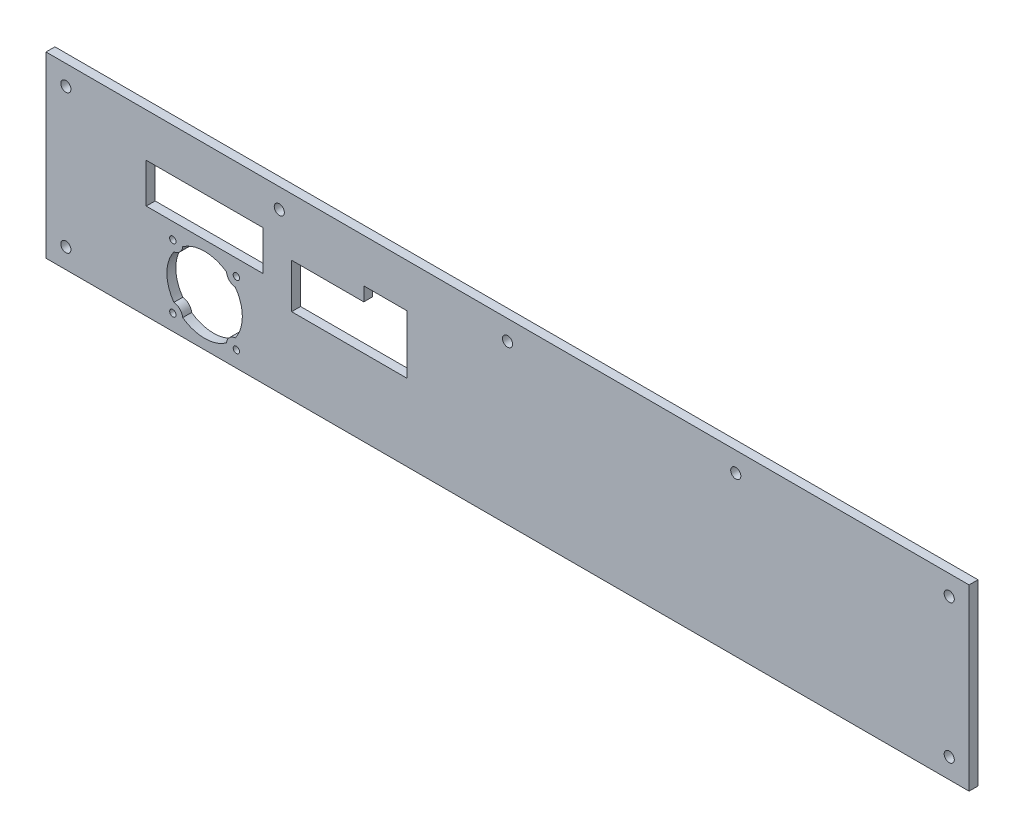
ISO-10303-21;
HEADER;
FILE_DESCRIPTION(('STEP AP214'),'2;1');
FILE_NAME('part.step','',(''),(''),'','','');
FILE_SCHEMA(('AUTOMOTIVE_DESIGN { 1 0 10303 214 1 1 1 1 }'));
ENDSEC;
DATA;
#1=APPLICATION_CONTEXT('core data for automotive mechanical design processes');
#2=APPLICATION_PROTOCOL_DEFINITION('international standard','automotive_design',2000,#1);
#3=PRODUCT_CONTEXT('',#1,'mechanical');
#4=PRODUCT('Part','Part','',(#3));
#5=PRODUCT_RELATED_PRODUCT_CATEGORY('part','',(#4));
#6=PRODUCT_DEFINITION_FORMATION('','',#4);
#7=PRODUCT_DEFINITION_CONTEXT('part definition',#1,'design');
#8=PRODUCT_DEFINITION('design','',#6,#7);
#9=PRODUCT_DEFINITION_SHAPE('','',#8);
#10=(LENGTH_UNIT() NAMED_UNIT(*) SI_UNIT(.MILLI.,.METRE.));
#11=(NAMED_UNIT(*) PLANE_ANGLE_UNIT() SI_UNIT($,.RADIAN.));
#12=(NAMED_UNIT(*) SI_UNIT($,.STERADIAN.) SOLID_ANGLE_UNIT());
#13=UNCERTAINTY_MEASURE_WITH_UNIT(LENGTH_MEASURE(1.E-05),#10,'distance_accuracy_value','');
#14=(GEOMETRIC_REPRESENTATION_CONTEXT(3) GLOBAL_UNCERTAINTY_ASSIGNED_CONTEXT((#13)) GLOBAL_UNIT_ASSIGNED_CONTEXT((#10,
#11,#12)) REPRESENTATION_CONTEXT('',''));
#15=CARTESIAN_POINT('',(0.,0.,0.));
#16=DIRECTION('',(0.,0.,1.));
#17=DIRECTION('',(1.,0.,0.));
#18=AXIS2_PLACEMENT_3D('',#15,#16,#17);
#19=CARTESIAN_POINT('',(0.,0.,2.2479));
#20=DIRECTION('',(0.,0.,-1.));
#21=DIRECTION('',(-1.,0.,0.));
#22=AXIS2_PLACEMENT_3D('',#19,#20,#21);
#23=PLANE('',#22);
#24=CARTESIAN_POINT('',(-168.6000064375,-4.99999999999986,2.2479));
#25=DIRECTION('',(0.,0.,-1.));
#26=DIRECTION('',(1.,0.,0.));
#27=AXIS2_PLACEMENT_3D('',#24,#25,#26);
#28=CIRCLE('',#27,4.99999999999998);
#29=CARTESIAN_POINT('',(-163.627957833171,-5.52795139567099,2.2479));
#30=VERTEX_POINT('',#29);
#31=CARTESIAN_POINT('',(-168.072055041829,-9.97204860432871,2.2479));
#32=VERTEX_POINT('',#31);
#33=EDGE_CURVE('E203',#30,#32,#28,.T.);
#34=ORIENTED_EDGE('',*,*,#33,.F.);
#35=CARTESIAN_POINT('',(-152.6000064375,-20.9999999999999,2.2479));
#36=DIRECTION('',(0.,0.,1.));
#37=DIRECTION('',(1.,0.,0.));
#38=AXIS2_PLACEMENT_3D('',#35,#36,#37);
#39=CIRCLE('',#38,19.);
#40=CARTESIAN_POINT('',(-141.572055041829,-5.52795139567098,2.2479));
#41=VERTEX_POINT('',#40);
#42=EDGE_CURVE('E49',#41,#30,#39,.T.);
#43=ORIENTED_EDGE('',*,*,#42,.F.);
#44=CARTESIAN_POINT('',(-136.6000064375,-4.99999999999986,2.2479));
#45=DIRECTION('',(0.,0.,-1.));
#46=DIRECTION('',(1.,0.,0.));
#47=AXIS2_PLACEMENT_3D('',#44,#45,#46);
#48=CIRCLE('',#47,4.99999999999995);
#49=CARTESIAN_POINT('',(-137.127957833171,-9.9720486043287,2.2479));
#50=VERTEX_POINT('',#49);
#51=EDGE_CURVE('E195',#50,#41,#48,.T.);
#52=ORIENTED_EDGE('',*,*,#51,.F.);
#53=CARTESIAN_POINT('',(-152.6000064375,-20.9999999999999,2.2479));
#54=DIRECTION('',(0.,0.,1.));
#55=DIRECTION('',(1.,0.,0.));
#56=AXIS2_PLACEMENT_3D('',#53,#54,#55);
#57=CIRCLE('',#56,19.);
#58=CARTESIAN_POINT('',(-137.127957833171,-32.027951395671,2.2479));
#59=VERTEX_POINT('',#58);
#60=EDGE_CURVE('E222',#59,#50,#57,.T.);
#61=ORIENTED_EDGE('',*,*,#60,.F.);
#62=CARTESIAN_POINT('',(-136.6000064375,-36.9999999999999,2.2479));
#63=DIRECTION('',(0.,0.,-1.));
#64=DIRECTION('',(1.,0.,0.));
#65=AXIS2_PLACEMENT_3D('',#62,#63,#64);
#66=CIRCLE('',#65,4.99999999999997);
#67=CARTESIAN_POINT('',(-141.572055041829,-36.4720486043287,2.2479));
#68=VERTEX_POINT('',#67);
#69=EDGE_CURVE('E219',#68,#59,#66,.T.);
#70=ORIENTED_EDGE('',*,*,#69,.F.);
#71=CARTESIAN_POINT('',(-152.6000064375,-20.9999999999999,2.2479));
#72=DIRECTION('',(0.,0.,1.));
#73=DIRECTION('',(1.,0.,0.));
#74=AXIS2_PLACEMENT_3D('',#71,#72,#73);
#75=CIRCLE('',#74,19.);
#76=CARTESIAN_POINT('',(-163.627957833171,-36.4720486043287,2.2479));
#77=VERTEX_POINT('',#76);
#78=EDGE_CURVE('E216',#77,#68,#75,.T.);
#79=ORIENTED_EDGE('',*,*,#78,.F.);
#80=CARTESIAN_POINT('',(-168.6000064375,-36.9999999999999,2.2479));
#81=DIRECTION('',(0.,0.,-1.));
#82=DIRECTION('',(1.,0.,0.));
#83=AXIS2_PLACEMENT_3D('',#80,#81,#82);
#84=CIRCLE('',#83,4.99999999999997);
#85=CARTESIAN_POINT('',(-168.072055041829,-32.027951395671,2.2479));
#86=VERTEX_POINT('',#85);
#87=EDGE_CURVE('E213',#86,#77,#84,.T.);
#88=ORIENTED_EDGE('',*,*,#87,.F.);
#89=CARTESIAN_POINT('',(-152.6000064375,-20.9999999999999,2.2479));
#90=DIRECTION('',(0.,0.,1.));
#91=DIRECTION('',(1.,0.,0.));
#92=AXIS2_PLACEMENT_3D('',#89,#90,#91);
#93=CIRCLE('',#92,19.);
#94=EDGE_CURVE('E210',#32,#86,#93,.T.);
#95=ORIENTED_EDGE('',*,*,#94,.F.);
#96=EDGE_LOOP('',(#34,#43,#52,#61,#70,#79,#88,#95));
#97=FACE_BOUND('',#96,.T.);
#98=CARTESIAN_POINT('',(-136.6000064375,-36.9999999999999,2.2479));
#99=DIRECTION('',(0.,0.,1.));
#100=DIRECTION('',(1.,0.,0.));
#101=AXIS2_PLACEMENT_3D('',#98,#99,#100);
#102=CIRCLE('',#101,1.59999999999999);
#103=CARTESIAN_POINT('',(-135.0000064375,-36.9999999999999,2.2479));
#104=VERTEX_POINT('',#103);
#105=EDGE_CURVE('E239',#104,#104,#102,.T.);
#106=ORIENTED_EDGE('',*,*,#105,.F.);
#107=EDGE_LOOP('',(#106));
#108=FACE_BOUND('',#107,.T.);
#109=CARTESIAN_POINT('',(-168.6000064375,-36.9999999999999,2.2479));
#110=DIRECTION('',(0.,0.,1.));
#111=DIRECTION('',(1.,0.,0.));
#112=AXIS2_PLACEMENT_3D('',#109,#110,#111);
#113=CIRCLE('',#112,1.59999999999999);
#114=CARTESIAN_POINT('',(-167.0000064375,-36.9999999999999,2.2479));
#115=VERTEX_POINT('',#114);
#116=EDGE_CURVE('E245',#115,#115,#113,.T.);
#117=ORIENTED_EDGE('',*,*,#116,.F.);
#118=EDGE_LOOP('',(#117));
#119=FACE_BOUND('',#118,.T.);
#120=CARTESIAN_POINT('',(-168.6000064375,-4.99999999999986,2.2479));
#121=DIRECTION('',(0.,0.,1.));
#122=DIRECTION('',(1.,0.,0.));
#123=AXIS2_PLACEMENT_3D('',#120,#121,#122);
#124=CIRCLE('',#123,1.59999999999999);
#125=CARTESIAN_POINT('',(-167.0000064375,-4.99999999999986,2.2479));
#126=VERTEX_POINT('',#125);
#127=EDGE_CURVE('E251',#126,#126,#124,.T.);
#128=ORIENTED_EDGE('',*,*,#127,.F.);
#129=EDGE_LOOP('',(#128));
#130=FACE_BOUND('',#129,.T.);
#131=CARTESIAN_POINT('',(-136.6000064375,-4.99999999999986,2.2479));
#132=DIRECTION('',(0.,0.,1.));
#133=DIRECTION('',(1.,0.,0.));
#134=AXIS2_PLACEMENT_3D('',#131,#132,#133);
#135=CIRCLE('',#134,1.59999999999999);
#136=CARTESIAN_POINT('',(-135.0000064375,-4.99999999999986,2.2479));
#137=VERTEX_POINT('',#136);
#138=EDGE_CURVE('E257',#137,#137,#135,.T.);
#139=ORIENTED_EDGE('',*,*,#138,.F.);
#140=EDGE_LOOP('',(#139));
#141=FACE_BOUND('',#140,.T.);
#142=DIRECTION('',(1.,0.,0.));
#143=VECTOR('',#142,1.);
#144=CARTESIAN_POINT('',(-182.0000064375,3.00000000000024,2.2479));
#145=LINE('',#144,#143);
#146=CARTESIAN_POINT('',(-182.0000064375,3.00000000000024,2.2479));
#147=VERTEX_POINT('',#146);
#148=CARTESIAN_POINT('',(-123.2000064375,3.00000000000024,2.2479));
#149=VERTEX_POINT('',#148);
#150=EDGE_CURVE('E273',#147,#149,#145,.T.);
#151=ORIENTED_EDGE('',*,*,#150,.F.);
#152=DIRECTION('',(0.,-1.,0.));
#153=VECTOR('',#152,1.);
#154=CARTESIAN_POINT('',(-182.0000064375,23.0000000000002,2.2479));
#155=LINE('',#154,#153);
#156=CARTESIAN_POINT('',(-182.0000064375,23.0000000000002,2.2479));
#157=VERTEX_POINT('',#156);
#158=EDGE_CURVE('E271',#157,#147,#155,.T.);
#159=ORIENTED_EDGE('',*,*,#158,.F.);
#160=DIRECTION('',(-1.,0.,0.));
#161=VECTOR('',#160,1.);
#162=CARTESIAN_POINT('',(-182.0000064375,23.0000000000002,2.2479));
#163=LINE('',#162,#161);
#164=CARTESIAN_POINT('',(-123.2000064375,23.0000000000002,2.2479));
#165=VERTEX_POINT('',#164);
#166=EDGE_CURVE('E279',#165,#157,#163,.T.);
#167=ORIENTED_EDGE('',*,*,#166,.F.);
#168=DIRECTION('',(0.,1.,0.));
#169=VECTOR('',#168,1.);
#170=CARTESIAN_POINT('',(-123.2000064375,23.0000000000002,2.2479));
#171=LINE('',#170,#169);
#172=EDGE_CURVE('E276',#149,#165,#171,.T.);
#173=ORIENTED_EDGE('',*,*,#172,.F.);
#174=EDGE_LOOP('',(#151,#159,#167,#173));
#175=FACE_BOUND('',#174,.T.);
#176=DIRECTION('',(1.,0.,0.));
#177=VECTOR('',#176,1.);
#178=CARTESIAN_POINT('',(-108.747160908634,-6.43000000000035,2.2479));
#179=LINE('',#178,#177);
#180=CARTESIAN_POINT('',(-108.747160908634,-6.43000000000035,2.2479));
#181=VERTEX_POINT('',#180);
#182=CARTESIAN_POINT('',(-50.5423399738689,-6.43000000000035,2.2479));
#183=VERTEX_POINT('',#182);
#184=EDGE_CURVE('E311',#181,#183,#179,.T.);
#185=ORIENTED_EDGE('',*,*,#184,.F.);
#186=DIRECTION('',(0.,-1.,0.));
#187=VECTOR('',#186,1.);
#188=CARTESIAN_POINT('',(-108.747160908634,15.9999999999997,2.2479));
#189=LINE('',#188,#187);
#190=CARTESIAN_POINT('',(-108.747160908634,15.9999999999997,2.2479));
#191=VERTEX_POINT('',#190);
#192=EDGE_CURVE('E309',#191,#181,#189,.T.);
#193=ORIENTED_EDGE('',*,*,#192,.F.);
#194=DIRECTION('',(-1.,0.,0.));
#195=VECTOR('',#194,1.);
#196=CARTESIAN_POINT('',(-108.747160908634,15.9999999999997,2.2479));
#197=LINE('',#196,#195);
#198=CARTESIAN_POINT('',(-72.4223399738689,15.9999999999998,2.2479));
#199=VERTEX_POINT('',#198);
#200=EDGE_CURVE('E323',#199,#191,#197,.T.);
#201=ORIENTED_EDGE('',*,*,#200,.F.);
#202=DIRECTION('',(0.,-1.,0.));
#203=VECTOR('',#202,1.);
#204=CARTESIAN_POINT('',(-72.4223399738689,15.9999999999998,2.2479));
#205=LINE('',#204,#203);
#206=CARTESIAN_POINT('',(-72.4223399738689,22.9999999999998,2.2479));
#207=VERTEX_POINT('',#206);
#208=EDGE_CURVE('E320',#207,#199,#205,.T.);
#209=ORIENTED_EDGE('',*,*,#208,.F.);
#210=DIRECTION('',(-1.,0.,0.));
#211=VECTOR('',#210,1.);
#212=CARTESIAN_POINT('',(-50.5423399738689,22.9999999999998,2.2479));
#213=LINE('',#212,#211);
#214=CARTESIAN_POINT('',(-50.5423399738689,22.9999999999998,2.2479));
#215=VERTEX_POINT('',#214);
#216=EDGE_CURVE('E317',#215,#207,#213,.T.);
#217=ORIENTED_EDGE('',*,*,#216,.F.);
#218=DIRECTION('',(0.,1.,0.));
#219=VECTOR('',#218,1.);
#220=CARTESIAN_POINT('',(-50.5423399738689,22.9999999999998,2.2479));
#221=LINE('',#220,#219);
#222=EDGE_CURVE('E314',#183,#215,#221,.T.);
#223=ORIENTED_EDGE('',*,*,#222,.F.);
#224=EDGE_LOOP('',(#185,#193,#201,#209,#217,#223));
#225=FACE_BOUND('',#224,.T.);
#226=CARTESIAN_POINT('',(222.5,35.,2.2479));
#227=DIRECTION('',(0.,0.,1.));
#228=DIRECTION('',(-1.,0.,0.));
#229=AXIS2_PLACEMENT_3D('',#226,#227,#228);
#230=CIRCLE('',#229,2.54999999999999);
#231=CARTESIAN_POINT('',(219.95,35.,2.2479));
#232=VERTEX_POINT('',#231);
#233=EDGE_CURVE('E349',#232,#232,#230,.T.);
#234=ORIENTED_EDGE('',*,*,#233,.F.);
#235=EDGE_LOOP('',(#234));
#236=FACE_BOUND('',#235,.T.);
#237=CARTESIAN_POINT('',(-114.975,35.,2.2479));
#238=DIRECTION('',(0.,0.,1.));
#239=DIRECTION('',(1.,0.,0.));
#240=AXIS2_PLACEMENT_3D('',#237,#238,#239);
#241=CIRCLE('',#240,2.54999999999999);
#242=CARTESIAN_POINT('',(-112.425,35.,2.2479));
#243=VERTEX_POINT('',#242);
#244=EDGE_CURVE('E361',#243,#243,#241,.T.);
#245=ORIENTED_EDGE('',*,*,#244,.F.);
#246=EDGE_LOOP('',(#245));
#247=FACE_BOUND('',#246,.T.);
#248=CARTESIAN_POINT('',(-222.5,-35.,2.2479));
#249=DIRECTION('',(0.,0.,1.));
#250=DIRECTION('',(1.,0.,0.));
#251=AXIS2_PLACEMENT_3D('',#248,#249,#250);
#252=CIRCLE('',#251,2.54999999999999);
#253=CARTESIAN_POINT('',(-219.95,-35.,2.2479));
#254=VERTEX_POINT('',#253);
#255=EDGE_CURVE('E373',#254,#254,#252,.T.);
#256=ORIENTED_EDGE('',*,*,#255,.F.);
#257=EDGE_LOOP('',(#256));
#258=FACE_BOUND('',#257,.T.);
#259=DIRECTION('',(0.,1.,0.));
#260=VECTOR('',#259,1.);
#261=CARTESIAN_POINT('',(232.5,-45.,2.2479));
#262=LINE('',#261,#260);
#263=CARTESIAN_POINT('',(232.5,-45.,2.2479));
#264=VERTEX_POINT('',#263);
#265=CARTESIAN_POINT('',(232.5,45.,2.2479));
#266=VERTEX_POINT('',#265);
#267=EDGE_CURVE('E385',#264,#266,#262,.T.);
#268=ORIENTED_EDGE('',*,*,#267,.T.);
#269=DIRECTION('',(-1.,0.,0.));
#270=VECTOR('',#269,1.);
#271=CARTESIAN_POINT('',(-232.5,45.,2.2479));
#272=LINE('',#271,#270);
#273=CARTESIAN_POINT('',(-232.5,45.,2.2479));
#274=VERTEX_POINT('',#273);
#275=EDGE_CURVE('E388',#266,#274,#272,.T.);
#276=ORIENTED_EDGE('',*,*,#275,.T.);
#277=DIRECTION('',(0.,-1.,0.));
#278=VECTOR('',#277,1.);
#279=CARTESIAN_POINT('',(-232.5,-45.,2.2479));
#280=LINE('',#279,#278);
#281=CARTESIAN_POINT('',(-232.5,-45.,2.2479));
#282=VERTEX_POINT('',#281);
#283=EDGE_CURVE('E391',#274,#282,#280,.T.);
#284=ORIENTED_EDGE('',*,*,#283,.T.);
#285=DIRECTION('',(1.,0.,0.));
#286=VECTOR('',#285,1.);
#287=CARTESIAN_POINT('',(-232.5,-45.,2.2479));
#288=LINE('',#287,#286);
#289=EDGE_CURVE('E393',#282,#264,#288,.T.);
#290=ORIENTED_EDGE('',*,*,#289,.T.);
#291=EDGE_LOOP('',(#268,#276,#284,#290));
#292=FACE_BOUND('',#291,.T.);
#293=CARTESIAN_POINT('',(-222.5,35.,2.2479));
#294=DIRECTION('',(0.,0.,1.));
#295=DIRECTION('',(1.,0.,0.));
#296=AXIS2_PLACEMENT_3D('',#293,#294,#295);
#297=CIRCLE('',#296,2.54999999999999);
#298=CARTESIAN_POINT('',(-219.95,35.,2.2479));
#299=VERTEX_POINT('',#298);
#300=EDGE_CURVE('E379',#299,#299,#297,.T.);
#301=ORIENTED_EDGE('',*,*,#300,.F.);
#302=EDGE_LOOP('',(#301));
#303=FACE_BOUND('',#302,.T.);
#304=CARTESIAN_POINT('',(0.,35.,2.2479));
#305=DIRECTION('',(0.,0.,1.));
#306=DIRECTION('',(1.,0.,0.));
#307=AXIS2_PLACEMENT_3D('',#304,#305,#306);
#308=CIRCLE('',#307,2.55);
#309=CARTESIAN_POINT('',(2.55,35.,2.2479));
#310=VERTEX_POINT('',#309);
#311=EDGE_CURVE('E367',#310,#310,#308,.T.);
#312=ORIENTED_EDGE('',*,*,#311,.F.);
#313=EDGE_LOOP('',(#312));
#314=FACE_BOUND('',#313,.T.);
#315=CARTESIAN_POINT('',(222.5,-34.9999999999999,2.2479));
#316=DIRECTION('',(0.,0.,1.));
#317=DIRECTION('',(-1.,0.,0.));
#318=AXIS2_PLACEMENT_3D('',#315,#316,#317);
#319=CIRCLE('',#318,2.54999999999999);
#320=CARTESIAN_POINT('',(219.95,-34.9999999999999,2.2479));
#321=VERTEX_POINT('',#320);
#322=EDGE_CURVE('E355',#321,#321,#319,.T.);
#323=ORIENTED_EDGE('',*,*,#322,.F.);
#324=EDGE_LOOP('',(#323));
#325=FACE_BOUND('',#324,.T.);
#326=CARTESIAN_POINT('',(114.975,35.,2.2479));
#327=DIRECTION('',(0.,0.,1.));
#328=DIRECTION('',(-1.,0.,0.));
#329=AXIS2_PLACEMENT_3D('',#326,#327,#328);
#330=CIRCLE('',#329,2.54999999999999);
#331=CARTESIAN_POINT('',(112.425,35.,2.2479));
#332=VERTEX_POINT('',#331);
#333=EDGE_CURVE('E343',#332,#332,#330,.T.);
#334=ORIENTED_EDGE('',*,*,#333,.F.);
#335=EDGE_LOOP('',(#334));
#336=FACE_BOUND('',#335,.T.);
#337=ADVANCED_FACE('F34',(#97,#108,#119,#130,#141,#175,#225,#236,#247,#258,#292,#303,#314,#325,
#336),#23,.F.);
#338=CARTESIAN_POINT('',(0.,0.,-2.2479));
#339=DIRECTION('',(0.,0.,-1.));
#340=DIRECTION('',(-1.,0.,0.));
#341=AXIS2_PLACEMENT_3D('',#338,#339,#340);
#342=PLANE('',#341);
#343=CARTESIAN_POINT('',(-152.6000064375,-20.9999999999999,-2.2479));
#344=DIRECTION('',(0.,0.,-1.));
#345=DIRECTION('',(-1.,0.,0.));
#346=AXIS2_PLACEMENT_3D('',#343,#344,#345);
#347=CIRCLE('',#346,19.);
#348=CARTESIAN_POINT('',(-141.572055041829,-5.52795139567098,-2.2479));
#349=VERTEX_POINT('',#348);
#350=CARTESIAN_POINT('',(-163.627957833171,-5.52795139567099,-2.2479));
#351=VERTEX_POINT('',#350);
#352=EDGE_CURVE('E193',#349,#351,#347,.F.);
#353=ORIENTED_EDGE('',*,*,#352,.T.);
#354=CARTESIAN_POINT('',(-168.6000064375,-4.99999999999986,-2.2479));
#355=DIRECTION('',(0.,0.,-1.));
#356=DIRECTION('',(-1.,0.,0.));
#357=AXIS2_PLACEMENT_3D('',#354,#355,#356);
#358=CIRCLE('',#357,4.99999999999998);
#359=CARTESIAN_POINT('',(-168.072055041829,-9.97204860432872,-2.2479));
#360=VERTEX_POINT('',#359);
#361=EDGE_CURVE('E182',#351,#360,#358,.T.);
#362=ORIENTED_EDGE('',*,*,#361,.T.);
#363=CARTESIAN_POINT('',(-152.6000064375,-20.9999999999999,-2.2479));
#364=DIRECTION('',(0.,0.,-1.));
#365=DIRECTION('',(-1.,0.,0.));
#366=AXIS2_PLACEMENT_3D('',#363,#364,#365);
#367=CIRCLE('',#366,19.);
#368=CARTESIAN_POINT('',(-168.072055041829,-32.027951395671,-2.2479));
#369=VERTEX_POINT('',#368);
#370=EDGE_CURVE('E751',#360,#369,#367,.F.);
#371=ORIENTED_EDGE('',*,*,#370,.T.);
#372=CARTESIAN_POINT('',(-168.6000064375,-36.9999999999999,-2.2479));
#373=DIRECTION('',(0.,0.,-1.));
#374=DIRECTION('',(-1.,0.,0.));
#375=AXIS2_PLACEMENT_3D('',#372,#373,#374);
#376=CIRCLE('',#375,4.99999999999997);
#377=CARTESIAN_POINT('',(-163.627957833171,-36.4720486043287,-2.2479));
#378=VERTEX_POINT('',#377);
#379=EDGE_CURVE('E756',#369,#378,#376,.T.);
#380=ORIENTED_EDGE('',*,*,#379,.T.);
#381=CARTESIAN_POINT('',(-152.6000064375,-20.9999999999999,-2.2479));
#382=DIRECTION('',(0.,0.,-1.));
#383=DIRECTION('',(-1.,0.,0.));
#384=AXIS2_PLACEMENT_3D('',#381,#382,#383);
#385=CIRCLE('',#384,19.);
#386=CARTESIAN_POINT('',(-141.572055041829,-36.4720486043287,-2.2479));
#387=VERTEX_POINT('',#386);
#388=EDGE_CURVE('E759',#378,#387,#385,.F.);
#389=ORIENTED_EDGE('',*,*,#388,.T.);
#390=CARTESIAN_POINT('',(-136.6000064375,-36.9999999999999,-2.2479));
#391=DIRECTION('',(0.,0.,-1.));
#392=DIRECTION('',(-1.,0.,0.));
#393=AXIS2_PLACEMENT_3D('',#390,#391,#392);
#394=CIRCLE('',#393,4.99999999999997);
#395=CARTESIAN_POINT('',(-137.127957833171,-32.027951395671,-2.2479));
#396=VERTEX_POINT('',#395);
#397=EDGE_CURVE('E763',#387,#396,#394,.T.);
#398=ORIENTED_EDGE('',*,*,#397,.T.);
#399=CARTESIAN_POINT('',(-152.6000064375,-20.9999999999999,-2.2479));
#400=DIRECTION('',(0.,0.,-1.));
#401=DIRECTION('',(-1.,0.,0.));
#402=AXIS2_PLACEMENT_3D('',#399,#400,#401);
#403=CIRCLE('',#402,19.);
#404=CARTESIAN_POINT('',(-137.127957833171,-9.97204860432869,-2.2479));
#405=VERTEX_POINT('',#404);
#406=EDGE_CURVE('E205',#396,#405,#403,.F.);
#407=ORIENTED_EDGE('',*,*,#406,.T.);
#408=CARTESIAN_POINT('',(-136.6000064375,-4.99999999999986,-2.2479));
#409=DIRECTION('',(0.,0.,-1.));
#410=DIRECTION('',(-1.,0.,0.));
#411=AXIS2_PLACEMENT_3D('',#408,#409,#410);
#412=CIRCLE('',#411,4.99999999999995);
#413=EDGE_CURVE('E201',#405,#349,#412,.T.);
#414=ORIENTED_EDGE('',*,*,#413,.T.);
#415=EDGE_LOOP('',(#353,#362,#371,#380,#389,#398,#407,#414));
#416=FACE_BOUND('',#415,.T.);
#417=CARTESIAN_POINT('',(-136.6000064375,-36.9999999999999,-2.2479));
#418=DIRECTION('',(0.,0.,-1.));
#419=DIRECTION('',(-1.,0.,0.));
#420=AXIS2_PLACEMENT_3D('',#417,#418,#419);
#421=CIRCLE('',#420,1.59999999999999);
#422=CARTESIAN_POINT('',(-138.2000064375,-36.9999999999999,-2.2479));
#423=VERTEX_POINT('',#422);
#424=EDGE_CURVE('E189',#423,#423,#421,.F.);
#425=ORIENTED_EDGE('',*,*,#424,.T.);
#426=EDGE_LOOP('',(#425));
#427=FACE_BOUND('',#426,.T.);
#428=CARTESIAN_POINT('',(-168.6000064375,-36.9999999999999,-2.2479));
#429=DIRECTION('',(0.,0.,-1.));
#430=DIRECTION('',(-1.,0.,0.));
#431=AXIS2_PLACEMENT_3D('',#428,#429,#430);
#432=CIRCLE('',#431,1.59999999999999);
#433=CARTESIAN_POINT('',(-170.2000064375,-36.9999999999999,-2.2479));
#434=VERTEX_POINT('',#433);
#435=EDGE_CURVE('E242',#434,#434,#432,.F.);
#436=ORIENTED_EDGE('',*,*,#435,.T.);
#437=EDGE_LOOP('',(#436));
#438=FACE_BOUND('',#437,.T.);
#439=CARTESIAN_POINT('',(-168.6000064375,-4.99999999999986,-2.2479));
#440=DIRECTION('',(0.,0.,-1.));
#441=DIRECTION('',(-1.,0.,0.));
#442=AXIS2_PLACEMENT_3D('',#439,#440,#441);
#443=CIRCLE('',#442,1.59999999999999);
#444=CARTESIAN_POINT('',(-170.2000064375,-4.99999999999986,-2.2479));
#445=VERTEX_POINT('',#444);
#446=EDGE_CURVE('E248',#445,#445,#443,.F.);
#447=ORIENTED_EDGE('',*,*,#446,.T.);
#448=EDGE_LOOP('',(#447));
#449=FACE_BOUND('',#448,.T.);
#450=CARTESIAN_POINT('',(-136.6000064375,-4.99999999999986,-2.2479));
#451=DIRECTION('',(0.,0.,-1.));
#452=DIRECTION('',(-1.,0.,0.));
#453=AXIS2_PLACEMENT_3D('',#450,#451,#452);
#454=CIRCLE('',#453,1.59999999999999);
#455=CARTESIAN_POINT('',(-138.2000064375,-4.99999999999986,-2.2479));
#456=VERTEX_POINT('',#455);
#457=EDGE_CURVE('E254',#456,#456,#454,.F.);
#458=ORIENTED_EDGE('',*,*,#457,.T.);
#459=EDGE_LOOP('',(#458));
#460=FACE_BOUND('',#459,.T.);
#461=DIRECTION('',(0.,-1.,0.));
#462=VECTOR('',#461,1.);
#463=CARTESIAN_POINT('',(-182.0000064375,23.0000000000002,-2.2479));
#464=LINE('',#463,#462);
#465=CARTESIAN_POINT('',(-182.0000064375,23.0000000000002,-2.2479));
#466=VERTEX_POINT('',#465);
#467=CARTESIAN_POINT('',(-182.0000064375,3.00000000000024,-2.2479));
#468=VERTEX_POINT('',#467);
#469=EDGE_CURVE('E268',#466,#468,#464,.T.);
#470=ORIENTED_EDGE('',*,*,#469,.T.);
#471=DIRECTION('',(1.,0.,0.));
#472=VECTOR('',#471,1.);
#473=CARTESIAN_POINT('',(-182.0000064375,3.00000000000024,-2.2479));
#474=LINE('',#473,#472);
#475=CARTESIAN_POINT('',(-123.2000064375,3.00000000000024,-2.2479));
#476=VERTEX_POINT('',#475);
#477=EDGE_CURVE('E285',#468,#476,#474,.T.);
#478=ORIENTED_EDGE('',*,*,#477,.T.);
#479=DIRECTION('',(0.,1.,0.));
#480=VECTOR('',#479,1.);
#481=CARTESIAN_POINT('',(-123.2000064375,23.0000000000002,-2.2479));
#482=LINE('',#481,#480);
#483=CARTESIAN_POINT('',(-123.2000064375,23.0000000000002,-2.2479));
#484=VERTEX_POINT('',#483);
#485=EDGE_CURVE('E260',#476,#484,#482,.T.);
#486=ORIENTED_EDGE('',*,*,#485,.T.);
#487=DIRECTION('',(-1.,0.,0.));
#488=VECTOR('',#487,1.);
#489=CARTESIAN_POINT('',(-182.0000064375,23.0000000000002,-2.2479));
#490=LINE('',#489,#488);
#491=EDGE_CURVE('E265',#484,#466,#490,.T.);
#492=ORIENTED_EDGE('',*,*,#491,.T.);
#493=EDGE_LOOP('',(#470,#478,#486,#492));
#494=FACE_BOUND('',#493,.T.);
#495=DIRECTION('',(0.,-1.,0.));
#496=VECTOR('',#495,1.);
#497=CARTESIAN_POINT('',(-108.747160908634,15.9999999999997,-2.2479));
#498=LINE('',#497,#496);
#499=CARTESIAN_POINT('',(-108.747160908634,15.9999999999997,-2.2479));
#500=VERTEX_POINT('',#499);
#501=CARTESIAN_POINT('',(-108.747160908634,-6.43000000000035,-2.2479));
#502=VERTEX_POINT('',#501);
#503=EDGE_CURVE('E306',#500,#502,#498,.T.);
#504=ORIENTED_EDGE('',*,*,#503,.T.);
#505=DIRECTION('',(1.,0.,0.));
#506=VECTOR('',#505,1.);
#507=CARTESIAN_POINT('',(-108.747160908634,-6.43000000000035,-2.2479));
#508=LINE('',#507,#506);
#509=CARTESIAN_POINT('',(-50.5423399738689,-6.43000000000035,-2.2479));
#510=VERTEX_POINT('',#509);
#511=EDGE_CURVE('E329',#502,#510,#508,.T.);
#512=ORIENTED_EDGE('',*,*,#511,.T.);
#513=DIRECTION('',(0.,1.,0.));
#514=VECTOR('',#513,1.);
#515=CARTESIAN_POINT('',(-50.5423399738689,22.9999999999998,-2.2479));
#516=LINE('',#515,#514);
#517=CARTESIAN_POINT('',(-50.5423399738689,22.9999999999998,-2.2479));
#518=VERTEX_POINT('',#517);
#519=EDGE_CURVE('E294',#510,#518,#516,.T.);
#520=ORIENTED_EDGE('',*,*,#519,.T.);
#521=DIRECTION('',(-1.,0.,0.));
#522=VECTOR('',#521,1.);
#523=CARTESIAN_POINT('',(-50.5423399738689,22.9999999999998,-2.2479));
#524=LINE('',#523,#522);
#525=CARTESIAN_POINT('',(-72.4223399738689,22.9999999999998,-2.2479));
#526=VERTEX_POINT('',#525);
#527=EDGE_CURVE('E297',#518,#526,#524,.T.);
#528=ORIENTED_EDGE('',*,*,#527,.T.);
#529=DIRECTION('',(0.,-1.,0.));
#530=VECTOR('',#529,1.);
#531=CARTESIAN_POINT('',(-72.4223399738689,15.9999999999998,-2.2479));
#532=LINE('',#531,#530);
#533=CARTESIAN_POINT('',(-72.4223399738689,15.9999999999998,-2.2479));
#534=VERTEX_POINT('',#533);
#535=EDGE_CURVE('E300',#526,#534,#532,.T.);
#536=ORIENTED_EDGE('',*,*,#535,.T.);
#537=DIRECTION('',(-1.,0.,0.));
#538=VECTOR('',#537,1.);
#539=CARTESIAN_POINT('',(-108.747160908634,15.9999999999997,-2.2479));
#540=LINE('',#539,#538);
#541=EDGE_CURVE('E303',#534,#500,#540,.T.);
#542=ORIENTED_EDGE('',*,*,#541,.T.);
#543=EDGE_LOOP('',(#504,#512,#520,#528,#536,#542));
#544=FACE_BOUND('',#543,.T.);
#545=CARTESIAN_POINT('',(222.5,35.,-2.2479));
#546=DIRECTION('',(0.,0.,1.));
#547=DIRECTION('',(-1.,0.,0.));
#548=AXIS2_PLACEMENT_3D('',#545,#546,#547);
#549=CIRCLE('',#548,2.54999999999999);
#550=CARTESIAN_POINT('',(219.95,35.,-2.2479));
#551=VERTEX_POINT('',#550);
#552=EDGE_CURVE('E346',#551,#551,#549,.T.);
#553=ORIENTED_EDGE('',*,*,#552,.T.);
#554=EDGE_LOOP('',(#553));
#555=FACE_BOUND('',#554,.T.);
#556=CARTESIAN_POINT('',(-114.975,35.,-2.2479));
#557=DIRECTION('',(0.,0.,1.));
#558=DIRECTION('',(1.,0.,0.));
#559=AXIS2_PLACEMENT_3D('',#556,#557,#558);
#560=CIRCLE('',#559,2.54999999999999);
#561=CARTESIAN_POINT('',(-112.425,35.,-2.2479));
#562=VERTEX_POINT('',#561);
#563=EDGE_CURVE('E358',#562,#562,#560,.T.);
#564=ORIENTED_EDGE('',*,*,#563,.T.);
#565=EDGE_LOOP('',(#564));
#566=FACE_BOUND('',#565,.T.);
#567=CARTESIAN_POINT('',(-222.5,-35.,-2.2479));
#568=DIRECTION('',(0.,0.,1.));
#569=DIRECTION('',(1.,0.,0.));
#570=AXIS2_PLACEMENT_3D('',#567,#568,#569);
#571=CIRCLE('',#570,2.54999999999999);
#572=CARTESIAN_POINT('',(-219.95,-35.,-2.2479));
#573=VERTEX_POINT('',#572);
#574=EDGE_CURVE('E370',#573,#573,#571,.T.);
#575=ORIENTED_EDGE('',*,*,#574,.T.);
#576=EDGE_LOOP('',(#575));
#577=FACE_BOUND('',#576,.T.);
#578=DIRECTION('',(0.,1.,0.));
#579=VECTOR('',#578,1.);
#580=CARTESIAN_POINT('',(232.5,-45.,-2.2479));
#581=LINE('',#580,#579);
#582=CARTESIAN_POINT('',(232.5,-45.,-2.2479));
#583=VERTEX_POINT('',#582);
#584=CARTESIAN_POINT('',(232.5,45.,-2.2479));
#585=VERTEX_POINT('',#584);
#586=EDGE_CURVE('E382',#583,#585,#581,.T.);
#587=ORIENTED_EDGE('',*,*,#586,.F.);
#588=DIRECTION('',(1.,0.,0.));
#589=VECTOR('',#588,1.);
#590=CARTESIAN_POINT('',(-232.5,-45.,-2.2479));
#591=LINE('',#590,#589);
#592=CARTESIAN_POINT('',(-232.5,-45.,-2.2479));
#593=VERTEX_POINT('',#592);
#594=EDGE_CURVE('E389',#593,#583,#591,.T.);
#595=ORIENTED_EDGE('',*,*,#594,.F.);
#596=DIRECTION('',(0.,-1.,0.));
#597=VECTOR('',#596,1.);
#598=CARTESIAN_POINT('',(-232.5,-45.,-2.2479));
#599=LINE('',#598,#597);
#600=CARTESIAN_POINT('',(-232.5,45.,-2.2479));
#601=VERTEX_POINT('',#600);
#602=EDGE_CURVE('E400',#601,#593,#599,.T.);
#603=ORIENTED_EDGE('',*,*,#602,.F.);
#604=DIRECTION('',(-1.,0.,0.));
#605=VECTOR('',#604,1.);
#606=CARTESIAN_POINT('',(-232.5,45.,-2.2479));
#607=LINE('',#606,#605);
#608=EDGE_CURVE('E398',#585,#601,#607,.T.);
#609=ORIENTED_EDGE('',*,*,#608,.F.);
#610=EDGE_LOOP('',(#587,#595,#603,#609));
#611=FACE_BOUND('',#610,.T.);
#612=CARTESIAN_POINT('',(-222.5,35.,-2.2479));
#613=DIRECTION('',(0.,0.,1.));
#614=DIRECTION('',(1.,0.,0.));
#615=AXIS2_PLACEMENT_3D('',#612,#613,#614);
#616=CIRCLE('',#615,2.54999999999999);
#617=CARTESIAN_POINT('',(-219.95,35.,-2.2479));
#618=VERTEX_POINT('',#617);
#619=EDGE_CURVE('E376',#618,#618,#616,.T.);
#620=ORIENTED_EDGE('',*,*,#619,.T.);
#621=EDGE_LOOP('',(#620));
#622=FACE_BOUND('',#621,.T.);
#623=CARTESIAN_POINT('',(0.,35.,-2.2479));
#624=DIRECTION('',(0.,0.,1.));
#625=DIRECTION('',(1.,0.,0.));
#626=AXIS2_PLACEMENT_3D('',#623,#624,#625);
#627=CIRCLE('',#626,2.55);
#628=CARTESIAN_POINT('',(2.55,35.,-2.2479));
#629=VERTEX_POINT('',#628);
#630=EDGE_CURVE('E364',#629,#629,#627,.T.);
#631=ORIENTED_EDGE('',*,*,#630,.T.);
#632=EDGE_LOOP('',(#631));
#633=FACE_BOUND('',#632,.T.);
#634=CARTESIAN_POINT('',(222.5,-34.9999999999999,-2.2479));
#635=DIRECTION('',(0.,0.,1.));
#636=DIRECTION('',(-1.,0.,0.));
#637=AXIS2_PLACEMENT_3D('',#634,#635,#636);
#638=CIRCLE('',#637,2.54999999999999);
#639=CARTESIAN_POINT('',(219.95,-34.9999999999999,-2.2479));
#640=VERTEX_POINT('',#639);
#641=EDGE_CURVE('E352',#640,#640,#638,.T.);
#642=ORIENTED_EDGE('',*,*,#641,.T.);
#643=EDGE_LOOP('',(#642));
#644=FACE_BOUND('',#643,.T.);
#645=CARTESIAN_POINT('',(114.975,35.,-2.2479));
#646=DIRECTION('',(0.,0.,1.));
#647=DIRECTION('',(-1.,0.,0.));
#648=AXIS2_PLACEMENT_3D('',#645,#646,#647);
#649=CIRCLE('',#648,2.54999999999999);
#650=CARTESIAN_POINT('',(112.425,35.,-2.2479));
#651=VERTEX_POINT('',#650);
#652=EDGE_CURVE('E342',#651,#651,#649,.T.);
#653=ORIENTED_EDGE('',*,*,#652,.T.);
#654=EDGE_LOOP('',(#653));
#655=FACE_BOUND('',#654,.T.);
#656=ADVANCED_FACE('F198',(#416,#427,#438,#449,#460,#494,#544,#555,#566,#577,#611,#622,#633,
#644,#655),#342,.T.);
#657=CARTESIAN_POINT('',(232.5,-45.,2.2479));
#658=DIRECTION('',(-1.,0.,0.));
#659=DIRECTION('',(0.,0.,1.));
#660=AXIS2_PLACEMENT_3D('',#657,#658,#659);
#661=PLANE('',#660);
#662=ORIENTED_EDGE('',*,*,#586,.T.);
#663=DIRECTION('',(0.,0.,-1.));
#664=VECTOR('',#663,1.);
#665=CARTESIAN_POINT('',(232.5,45.,2.2479));
#666=LINE('',#665,#664);
#667=EDGE_CURVE('E11',#266,#585,#666,.T.);
#668=ORIENTED_EDGE('',*,*,#667,.F.);
#669=ORIENTED_EDGE('',*,*,#267,.F.);
#670=DIRECTION('',(0.,0.,-1.));
#671=VECTOR('',#670,1.);
#672=CARTESIAN_POINT('',(232.5,-45.,2.2479));
#673=LINE('',#672,#671);
#674=EDGE_CURVE('E395',#264,#583,#673,.T.);
#675=ORIENTED_EDGE('',*,*,#674,.T.);
#676=EDGE_LOOP('',(#662,#668,#669,#675));
#677=FACE_BOUND('',#676,.T.);
#678=ADVANCED_FACE('F36',(#677),#661,.F.);
#679=CARTESIAN_POINT('',(-232.5,45.,2.2479));
#680=DIRECTION('',(0.,-1.,0.));
#681=DIRECTION('',(0.,0.,-1.));
#682=AXIS2_PLACEMENT_3D('',#679,#680,#681);
#683=PLANE('',#682);
#684=ORIENTED_EDGE('',*,*,#608,.T.);
#685=DIRECTION('',(0.,0.,-1.));
#686=VECTOR('',#685,1.);
#687=CARTESIAN_POINT('',(-232.5,45.,2.2479));
#688=LINE('',#687,#686);
#689=EDGE_CURVE('E42',#274,#601,#688,.T.);
#690=ORIENTED_EDGE('',*,*,#689,.F.);
#691=ORIENTED_EDGE('',*,*,#275,.F.);
#692=ORIENTED_EDGE('',*,*,#667,.T.);
#693=EDGE_LOOP('',(#684,#690,#691,#692));
#694=FACE_BOUND('',#693,.T.);
#695=ADVANCED_FACE('F428',(#694),#683,.F.);
#696=CARTESIAN_POINT('',(-232.5,-45.,2.2479));
#697=DIRECTION('',(1.,0.,0.));
#698=DIRECTION('',(0.,0.,-1.));
#699=AXIS2_PLACEMENT_3D('',#696,#697,#698);
#700=PLANE('',#699);
#701=ORIENTED_EDGE('',*,*,#602,.T.);
#702=DIRECTION('',(0.,0.,-1.));
#703=VECTOR('',#702,1.);
#704=CARTESIAN_POINT('',(-232.5,-45.,2.2479));
#705=LINE('',#704,#703);
#706=EDGE_CURVE('E405',#282,#593,#705,.T.);
#707=ORIENTED_EDGE('',*,*,#706,.F.);
#708=ORIENTED_EDGE('',*,*,#283,.F.);
#709=ORIENTED_EDGE('',*,*,#689,.T.);
#710=EDGE_LOOP('',(#701,#707,#708,#709));
#711=FACE_BOUND('',#710,.T.);
#712=ADVANCED_FACE('F412',(#711),#700,.F.);
#713=CARTESIAN_POINT('',(-232.5,-45.,2.2479));
#714=DIRECTION('',(0.,1.,0.));
#715=DIRECTION('',(0.,0.,1.));
#716=AXIS2_PLACEMENT_3D('',#713,#714,#715);
#717=PLANE('',#716);
#718=ORIENTED_EDGE('',*,*,#594,.T.);
#719=ORIENTED_EDGE('',*,*,#674,.F.);
#720=ORIENTED_EDGE('',*,*,#289,.F.);
#721=ORIENTED_EDGE('',*,*,#706,.T.);
#722=EDGE_LOOP('',(#718,#719,#720,#721));
#723=FACE_BOUND('',#722,.T.);
#724=ADVANCED_FACE('F421',(#723),#717,.F.);
#725=CARTESIAN_POINT('',(-222.5,35.,2.2479));
#726=DIRECTION('',(0.,0.,-1.));
#727=DIRECTION('',(-1.,0.,0.));
#728=AXIS2_PLACEMENT_3D('',#725,#726,#727);
#729=CYLINDRICAL_SURFACE('',#728,2.54999999999999);
#730=ORIENTED_EDGE('',*,*,#300,.T.);
#731=EDGE_LOOP('',(#730));
#732=FACE_BOUND('',#731,.T.);
#733=ORIENTED_EDGE('',*,*,#619,.F.);
#734=EDGE_LOOP('',(#733));
#735=FACE_BOUND('',#734,.T.);
#736=ADVANCED_FACE('F444',(#732,#735),#729,.F.);
#737=CARTESIAN_POINT('',(-222.5,-35.,2.2479));
#738=DIRECTION('',(0.,0.,-1.));
#739=DIRECTION('',(-1.,0.,0.));
#740=AXIS2_PLACEMENT_3D('',#737,#738,#739);
#741=CYLINDRICAL_SURFACE('',#740,2.54999999999999);
#742=ORIENTED_EDGE('',*,*,#255,.T.);
#743=EDGE_LOOP('',(#742));
#744=FACE_BOUND('',#743,.T.);
#745=ORIENTED_EDGE('',*,*,#574,.F.);
#746=EDGE_LOOP('',(#745));
#747=FACE_BOUND('',#746,.T.);
#748=ADVANCED_FACE('F451',(#744,#747),#741,.F.);
#749=CARTESIAN_POINT('',(0.,35.,2.2479));
#750=DIRECTION('',(0.,0.,-1.));
#751=DIRECTION('',(-1.,0.,0.));
#752=AXIS2_PLACEMENT_3D('',#749,#750,#751);
#753=CYLINDRICAL_SURFACE('',#752,2.55);
#754=ORIENTED_EDGE('',*,*,#311,.T.);
#755=EDGE_LOOP('',(#754));
#756=FACE_BOUND('',#755,.T.);
#757=ORIENTED_EDGE('',*,*,#630,.F.);
#758=EDGE_LOOP('',(#757));
#759=FACE_BOUND('',#758,.T.);
#760=ADVANCED_FACE('F456',(#756,#759),#753,.F.);
#761=CARTESIAN_POINT('',(-114.975,35.,2.2479));
#762=DIRECTION('',(0.,0.,-1.));
#763=DIRECTION('',(-1.,0.,0.));
#764=AXIS2_PLACEMENT_3D('',#761,#762,#763);
#765=CYLINDRICAL_SURFACE('',#764,2.54999999999999);
#766=ORIENTED_EDGE('',*,*,#244,.T.);
#767=EDGE_LOOP('',(#766));
#768=FACE_BOUND('',#767,.T.);
#769=ORIENTED_EDGE('',*,*,#563,.F.);
#770=EDGE_LOOP('',(#769));
#771=FACE_BOUND('',#770,.T.);
#772=ADVANCED_FACE('F488',(#768,#771),#765,.F.);
#773=CARTESIAN_POINT('',(222.5,-34.9999999999999,2.2479));
#774=DIRECTION('',(0.,0.,-1.));
#775=DIRECTION('',(-1.,0.,0.));
#776=AXIS2_PLACEMENT_3D('',#773,#774,#775);
#777=CYLINDRICAL_SURFACE('',#776,2.54999999999999);
#778=ORIENTED_EDGE('',*,*,#322,.T.);
#779=EDGE_LOOP('',(#778));
#780=FACE_BOUND('',#779,.T.);
#781=ORIENTED_EDGE('',*,*,#641,.F.);
#782=EDGE_LOOP('',(#781));
#783=FACE_BOUND('',#782,.T.);
#784=ADVANCED_FACE('F481',(#780,#783),#777,.F.);
#785=CARTESIAN_POINT('',(222.5,35.,2.2479));
#786=DIRECTION('',(0.,0.,-1.));
#787=DIRECTION('',(-1.,0.,0.));
#788=AXIS2_PLACEMENT_3D('',#785,#786,#787);
#789=CYLINDRICAL_SURFACE('',#788,2.54999999999999);
#790=ORIENTED_EDGE('',*,*,#233,.T.);
#791=EDGE_LOOP('',(#790));
#792=FACE_BOUND('',#791,.T.);
#793=ORIENTED_EDGE('',*,*,#552,.F.);
#794=EDGE_LOOP('',(#793));
#795=FACE_BOUND('',#794,.T.);
#796=ADVANCED_FACE('F471',(#792,#795),#789,.F.);
#797=CARTESIAN_POINT('',(114.975,35.,2.2479));
#798=DIRECTION('',(0.,0.,-1.));
#799=DIRECTION('',(-1.,0.,0.));
#800=AXIS2_PLACEMENT_3D('',#797,#798,#799);
#801=CYLINDRICAL_SURFACE('',#800,2.54999999999999);
#802=ORIENTED_EDGE('',*,*,#333,.T.);
#803=EDGE_LOOP('',(#802));
#804=FACE_BOUND('',#803,.T.);
#805=ORIENTED_EDGE('',*,*,#652,.F.);
#806=EDGE_LOOP('',(#805));
#807=FACE_BOUND('',#806,.T.);
#808=ADVANCED_FACE('F468',(#804,#807),#801,.F.);
#809=CARTESIAN_POINT('',(-108.747160908634,15.9999999999997,-2.2489));
#810=DIRECTION('',(-1.,0.,0.));
#811=DIRECTION('',(0.,0.,1.));
#812=AXIS2_PLACEMENT_3D('',#809,#810,#811);
#813=PLANE('',#812);
#814=DIRECTION('',(0.,0.,1.));
#815=VECTOR('',#814,1.);
#816=CARTESIAN_POINT('',(-108.747160908634,15.9999999999997,-2.2489));
#817=LINE('',#816,#815);
#818=EDGE_CURVE('E327',#500,#191,#817,.T.);
#819=ORIENTED_EDGE('',*,*,#818,.T.);
#820=ORIENTED_EDGE('',*,*,#192,.T.);
#821=DIRECTION('',(0.,0.,1.));
#822=VECTOR('',#821,1.);
#823=CARTESIAN_POINT('',(-108.747160908634,-6.43000000000035,-2.2489));
#824=LINE('',#823,#822);
#825=EDGE_CURVE('E326',#502,#181,#824,.T.);
#826=ORIENTED_EDGE('',*,*,#825,.F.);
#827=ORIENTED_EDGE('',*,*,#503,.F.);
#828=EDGE_LOOP('',(#819,#820,#826,#827));
#829=FACE_BOUND('',#828,.T.);
#830=ADVANCED_FACE('F470',(#829),#813,.F.);
#831=CARTESIAN_POINT('',(-108.747160908634,15.9999999999997,-2.2489));
#832=DIRECTION('',(0.,1.,0.));
#833=DIRECTION('',(-1.,0.,0.));
#834=AXIS2_PLACEMENT_3D('',#831,#832,#833);
#835=PLANE('',#834);
#836=DIRECTION('',(0.,0.,1.));
#837=VECTOR('',#836,1.);
#838=CARTESIAN_POINT('',(-72.4223399738689,15.9999999999998,-2.2489));
#839=LINE('',#838,#837);
#840=EDGE_CURVE('E330',#534,#199,#839,.T.);
#841=ORIENTED_EDGE('',*,*,#840,.T.);
#842=ORIENTED_EDGE('',*,*,#200,.T.);
#843=ORIENTED_EDGE('',*,*,#818,.F.);
#844=ORIENTED_EDGE('',*,*,#541,.F.);
#845=EDGE_LOOP('',(#841,#842,#843,#844));
#846=FACE_BOUND('',#845,.T.);
#847=ADVANCED_FACE('F478',(#846),#835,.F.);
#848=CARTESIAN_POINT('',(-72.4223399738689,15.9999999999998,-2.2489));
#849=DIRECTION('',(-1.,0.,0.));
#850=DIRECTION('',(0.,0.,1.));
#851=AXIS2_PLACEMENT_3D('',#848,#849,#850);
#852=PLANE('',#851);
#853=DIRECTION('',(0.,0.,1.));
#854=VECTOR('',#853,1.);
#855=CARTESIAN_POINT('',(-72.4223399738689,22.9999999999998,-2.2489));
#856=LINE('',#855,#854);
#857=EDGE_CURVE('E332',#526,#207,#856,.T.);
#858=ORIENTED_EDGE('',*,*,#857,.T.);
#859=ORIENTED_EDGE('',*,*,#208,.T.);
#860=ORIENTED_EDGE('',*,*,#840,.F.);
#861=ORIENTED_EDGE('',*,*,#535,.F.);
#862=EDGE_LOOP('',(#858,#859,#860,#861));
#863=FACE_BOUND('',#862,.T.);
#864=ADVANCED_FACE('F549',(#863),#852,.F.);
#865=CARTESIAN_POINT('',(-50.5423399738689,22.9999999999998,-2.2489));
#866=DIRECTION('',(0.,1.,0.));
#867=DIRECTION('',(-1.,0.,0.));
#868=AXIS2_PLACEMENT_3D('',#865,#866,#867);
#869=PLANE('',#868);
#870=DIRECTION('',(0.,0.,1.));
#871=VECTOR('',#870,1.);
#872=CARTESIAN_POINT('',(-50.5423399738689,22.9999999999998,-2.2489));
#873=LINE('',#872,#871);
#874=EDGE_CURVE('E334',#518,#215,#873,.T.);
#875=ORIENTED_EDGE('',*,*,#874,.T.);
#876=ORIENTED_EDGE('',*,*,#216,.T.);
#877=ORIENTED_EDGE('',*,*,#857,.F.);
#878=ORIENTED_EDGE('',*,*,#527,.F.);
#879=EDGE_LOOP('',(#875,#876,#877,#878));
#880=FACE_BOUND('',#879,.T.);
#881=ADVANCED_FACE('F559',(#880),#869,.F.);
#882=CARTESIAN_POINT('',(-50.5423399738689,22.9999999999998,-2.2489));
#883=DIRECTION('',(1.,0.,0.));
#884=DIRECTION('',(0.,0.,-1.));
#885=AXIS2_PLACEMENT_3D('',#882,#883,#884);
#886=PLANE('',#885);
#887=DIRECTION('',(0.,0.,1.));
#888=VECTOR('',#887,1.);
#889=CARTESIAN_POINT('',(-50.5423399738689,-6.43000000000035,-2.2489));
#890=LINE('',#889,#888);
#891=EDGE_CURVE('E336',#510,#183,#890,.T.);
#892=ORIENTED_EDGE('',*,*,#891,.T.);
#893=ORIENTED_EDGE('',*,*,#222,.T.);
#894=ORIENTED_EDGE('',*,*,#874,.F.);
#895=ORIENTED_EDGE('',*,*,#519,.F.);
#896=EDGE_LOOP('',(#892,#893,#894,#895));
#897=FACE_BOUND('',#896,.T.);
#898=ADVANCED_FACE('F569',(#897),#886,.F.);
#899=CARTESIAN_POINT('',(-108.747160908634,-6.43000000000035,-2.2489));
#900=DIRECTION('',(0.,-1.,0.));
#901=DIRECTION('',(0.,0.,-1.));
#902=AXIS2_PLACEMENT_3D('',#899,#900,#901);
#903=PLANE('',#902);
#904=ORIENTED_EDGE('',*,*,#825,.T.);
#905=ORIENTED_EDGE('',*,*,#184,.T.);
#906=ORIENTED_EDGE('',*,*,#891,.F.);
#907=ORIENTED_EDGE('',*,*,#511,.F.);
#908=EDGE_LOOP('',(#904,#905,#906,#907));
#909=FACE_BOUND('',#908,.T.);
#910=ADVANCED_FACE('F579',(#909),#903,.F.);
#911=CARTESIAN_POINT('',(-182.0000064375,23.0000000000002,-2.2489));
#912=DIRECTION('',(-1.,0.,0.));
#913=DIRECTION('',(0.,0.,1.));
#914=AXIS2_PLACEMENT_3D('',#911,#912,#913);
#915=PLANE('',#914);
#916=DIRECTION('',(0.,0.,1.));
#917=VECTOR('',#916,1.);
#918=CARTESIAN_POINT('',(-182.0000064375,23.0000000000002,-2.2489));
#919=LINE('',#918,#917);
#920=EDGE_CURVE('E283',#466,#157,#919,.T.);
#921=ORIENTED_EDGE('',*,*,#920,.T.);
#922=ORIENTED_EDGE('',*,*,#158,.T.);
#923=DIRECTION('',(0.,0.,1.));
#924=VECTOR('',#923,1.);
#925=CARTESIAN_POINT('',(-182.0000064375,3.00000000000024,-2.2489));
#926=LINE('',#925,#924);
#927=EDGE_CURVE('E282',#468,#147,#926,.T.);
#928=ORIENTED_EDGE('',*,*,#927,.F.);
#929=ORIENTED_EDGE('',*,*,#469,.F.);
#930=EDGE_LOOP('',(#921,#922,#928,#929));
#931=FACE_BOUND('',#930,.T.);
#932=ADVANCED_FACE('F589',(#931),#915,.F.);
#933=CARTESIAN_POINT('',(-182.0000064375,23.0000000000002,-2.2489));
#934=DIRECTION('',(0.,1.,0.));
#935=DIRECTION('',(0.,0.,1.));
#936=AXIS2_PLACEMENT_3D('',#933,#934,#935);
#937=PLANE('',#936);
#938=DIRECTION('',(0.,0.,1.));
#939=VECTOR('',#938,1.);
#940=CARTESIAN_POINT('',(-123.2000064375,23.0000000000002,-2.2489));
#941=LINE('',#940,#939);
#942=EDGE_CURVE('E286',#484,#165,#941,.T.);
#943=ORIENTED_EDGE('',*,*,#942,.T.);
#944=ORIENTED_EDGE('',*,*,#166,.T.);
#945=ORIENTED_EDGE('',*,*,#920,.F.);
#946=ORIENTED_EDGE('',*,*,#491,.F.);
#947=EDGE_LOOP('',(#943,#944,#945,#946));
#948=FACE_BOUND('',#947,.T.);
#949=ADVANCED_FACE('F598',(#948),#937,.F.);
#950=CARTESIAN_POINT('',(-123.2000064375,23.0000000000002,-2.2489));
#951=DIRECTION('',(1.,0.,0.));
#952=DIRECTION('',(0.,0.,-1.));
#953=AXIS2_PLACEMENT_3D('',#950,#951,#952);
#954=PLANE('',#953);
#955=DIRECTION('',(0.,0.,1.));
#956=VECTOR('',#955,1.);
#957=CARTESIAN_POINT('',(-123.2000064375,3.00000000000024,-2.2489));
#958=LINE('',#957,#956);
#959=EDGE_CURVE('E288',#476,#149,#958,.T.);
#960=ORIENTED_EDGE('',*,*,#959,.T.);
#961=ORIENTED_EDGE('',*,*,#172,.T.);
#962=ORIENTED_EDGE('',*,*,#942,.F.);
#963=ORIENTED_EDGE('',*,*,#485,.F.);
#964=EDGE_LOOP('',(#960,#961,#962,#963));
#965=FACE_BOUND('',#964,.T.);
#966=ADVANCED_FACE('F608',(#965),#954,.F.);
#967=CARTESIAN_POINT('',(-182.0000064375,3.00000000000024,-2.2489));
#968=DIRECTION('',(0.,-1.,0.));
#969=DIRECTION('',(0.,0.,-1.));
#970=AXIS2_PLACEMENT_3D('',#967,#968,#969);
#971=PLANE('',#970);
#972=ORIENTED_EDGE('',*,*,#927,.T.);
#973=ORIENTED_EDGE('',*,*,#150,.T.);
#974=ORIENTED_EDGE('',*,*,#959,.F.);
#975=ORIENTED_EDGE('',*,*,#477,.F.);
#976=EDGE_LOOP('',(#972,#973,#974,#975));
#977=FACE_BOUND('',#976,.T.);
#978=ADVANCED_FACE('F618',(#977),#971,.F.);
#979=CARTESIAN_POINT('',(-136.6000064375,-4.99999999999986,-2.2489));
#980=DIRECTION('',(0.,0.,1.));
#981=DIRECTION('',(1.,0.,0.));
#982=AXIS2_PLACEMENT_3D('',#979,#980,#981);
#983=CYLINDRICAL_SURFACE('',#982,1.59999999999999);
#984=ORIENTED_EDGE('',*,*,#457,.F.);
#985=EDGE_LOOP('',(#984));
#986=FACE_BOUND('',#985,.T.);
#987=ORIENTED_EDGE('',*,*,#138,.T.);
#988=EDGE_LOOP('',(#987));
#989=FACE_BOUND('',#988,.T.);
#990=ADVANCED_FACE('F628',(#986,#989),#983,.F.);
#991=CARTESIAN_POINT('',(-168.6000064375,-4.99999999999986,-2.2489));
#992=DIRECTION('',(0.,0.,1.));
#993=DIRECTION('',(1.,0.,0.));
#994=AXIS2_PLACEMENT_3D('',#991,#992,#993);
#995=CYLINDRICAL_SURFACE('',#994,1.59999999999999);
#996=ORIENTED_EDGE('',*,*,#446,.F.);
#997=EDGE_LOOP('',(#996));
#998=FACE_BOUND('',#997,.T.);
#999=ORIENTED_EDGE('',*,*,#127,.T.);
#1000=EDGE_LOOP('',(#999));
#1001=FACE_BOUND('',#1000,.T.);
#1002=ADVANCED_FACE('F638',(#998,#1001),#995,.F.);
#1003=CARTESIAN_POINT('',(-168.6000064375,-36.9999999999999,-2.2489));
#1004=DIRECTION('',(0.,0.,1.));
#1005=DIRECTION('',(1.,0.,0.));
#1006=AXIS2_PLACEMENT_3D('',#1003,#1004,#1005);
#1007=CYLINDRICAL_SURFACE('',#1006,1.59999999999999);
#1008=ORIENTED_EDGE('',*,*,#435,.F.);
#1009=EDGE_LOOP('',(#1008));
#1010=FACE_BOUND('',#1009,.T.);
#1011=ORIENTED_EDGE('',*,*,#116,.T.);
#1012=EDGE_LOOP('',(#1011));
#1013=FACE_BOUND('',#1012,.T.);
#1014=ADVANCED_FACE('F648',(#1010,#1013),#1007,.F.);
#1015=CARTESIAN_POINT('',(-136.6000064375,-36.9999999999999,-2.2489));
#1016=DIRECTION('',(0.,0.,1.));
#1017=DIRECTION('',(1.,0.,0.));
#1018=AXIS2_PLACEMENT_3D('',#1015,#1016,#1017);
#1019=CYLINDRICAL_SURFACE('',#1018,1.59999999999999);
#1020=ORIENTED_EDGE('',*,*,#424,.F.);
#1021=EDGE_LOOP('',(#1020));
#1022=FACE_BOUND('',#1021,.T.);
#1023=ORIENTED_EDGE('',*,*,#105,.T.);
#1024=EDGE_LOOP('',(#1023));
#1025=FACE_BOUND('',#1024,.T.);
#1026=ADVANCED_FACE('F658',(#1022,#1025),#1019,.F.);
#1027=CARTESIAN_POINT('',(-152.6000064375,-20.9999999999999,-2.2489));
#1028=DIRECTION('',(0.,0.,1.));
#1029=DIRECTION('',(1.,0.,0.));
#1030=AXIS2_PLACEMENT_3D('',#1027,#1028,#1029);
#1031=CYLINDRICAL_SURFACE('',#1030,19.);
#1032=DIRECTION('',(0.,0.,1.));
#1033=VECTOR('',#1032,1.);
#1034=CARTESIAN_POINT('',(-141.572055041829,-5.52795139567098,-2.2489));
#1035=LINE('',#1034,#1033);
#1036=EDGE_CURVE('E190',#349,#41,#1035,.T.);
#1037=ORIENTED_EDGE('',*,*,#1036,.T.);
#1038=ORIENTED_EDGE('',*,*,#42,.T.);
#1039=DIRECTION('',(0.,0.,1.));
#1040=VECTOR('',#1039,1.);
#1041=CARTESIAN_POINT('',(-163.627957833171,-5.52795139567099,-2.2489));
#1042=LINE('',#1041,#1040);
#1043=EDGE_CURVE('E184',#351,#30,#1042,.T.);
#1044=ORIENTED_EDGE('',*,*,#1043,.F.);
#1045=ORIENTED_EDGE('',*,*,#352,.F.);
#1046=EDGE_LOOP('',(#1037,#1038,#1044,#1045));
#1047=FACE_BOUND('',#1046,.T.);
#1048=ADVANCED_FACE('F192',(#1047),#1031,.F.);
#1049=CARTESIAN_POINT('',(-136.6000064375,-4.99999999999986,-2.2489));
#1050=DIRECTION('',(0.,0.,1.));
#1051=DIRECTION('',(1.,0.,0.));
#1052=AXIS2_PLACEMENT_3D('',#1049,#1050,#1051);
#1053=CYLINDRICAL_SURFACE('',#1052,4.99999999999995);
#1054=DIRECTION('',(0.,0.,1.));
#1055=VECTOR('',#1054,1.);
#1056=CARTESIAN_POINT('',(-137.127957833171,-9.9720486043287,-2.2489));
#1057=LINE('',#1056,#1055);
#1058=EDGE_CURVE('E228',#405,#50,#1057,.T.);
#1059=ORIENTED_EDGE('',*,*,#1058,.T.);
#1060=ORIENTED_EDGE('',*,*,#51,.T.);
#1061=ORIENTED_EDGE('',*,*,#1036,.F.);
#1062=ORIENTED_EDGE('',*,*,#413,.F.);
#1063=EDGE_LOOP('',(#1059,#1060,#1061,#1062));
#1064=FACE_BOUND('',#1063,.T.);
#1065=ADVANCED_FACE('F677',(#1064),#1053,.T.);
#1066=CARTESIAN_POINT('',(-152.6000064375,-20.9999999999999,-2.2489));
#1067=DIRECTION('',(0.,0.,1.));
#1068=DIRECTION('',(1.,0.,0.));
#1069=AXIS2_PLACEMENT_3D('',#1066,#1067,#1068);
#1070=CYLINDRICAL_SURFACE('',#1069,19.);
#1071=DIRECTION('',(0.,0.,1.));
#1072=VECTOR('',#1071,1.);
#1073=CARTESIAN_POINT('',(-137.127957833171,-32.027951395671,-2.2489));
#1074=LINE('',#1073,#1072);
#1075=EDGE_CURVE('E230',#396,#59,#1074,.T.);
#1076=ORIENTED_EDGE('',*,*,#1075,.T.);
#1077=ORIENTED_EDGE('',*,*,#60,.T.);
#1078=ORIENTED_EDGE('',*,*,#1058,.F.);
#1079=ORIENTED_EDGE('',*,*,#406,.F.);
#1080=EDGE_LOOP('',(#1076,#1077,#1078,#1079));
#1081=FACE_BOUND('',#1080,.T.);
#1082=ADVANCED_FACE('F686',(#1081),#1070,.F.);
#1083=CARTESIAN_POINT('',(-136.6000064375,-36.9999999999999,-2.2489));
#1084=DIRECTION('',(0.,0.,1.));
#1085=DIRECTION('',(1.,0.,0.));
#1086=AXIS2_PLACEMENT_3D('',#1083,#1084,#1085);
#1087=CYLINDRICAL_SURFACE('',#1086,4.99999999999997);
#1088=DIRECTION('',(0.,0.,1.));
#1089=VECTOR('',#1088,1.);
#1090=CARTESIAN_POINT('',(-141.572055041829,-36.4720486043287,-2.2489));
#1091=LINE('',#1090,#1089);
#1092=EDGE_CURVE('E232',#387,#68,#1091,.T.);
#1093=ORIENTED_EDGE('',*,*,#1092,.T.);
#1094=ORIENTED_EDGE('',*,*,#69,.T.);
#1095=ORIENTED_EDGE('',*,*,#1075,.F.);
#1096=ORIENTED_EDGE('',*,*,#397,.F.);
#1097=EDGE_LOOP('',(#1093,#1094,#1095,#1096));
#1098=FACE_BOUND('',#1097,.T.);
#1099=ADVANCED_FACE('F696',(#1098),#1087,.T.);
#1100=CARTESIAN_POINT('',(-152.6000064375,-20.9999999999999,-2.2489));
#1101=DIRECTION('',(0.,0.,1.));
#1102=DIRECTION('',(1.,0.,0.));
#1103=AXIS2_PLACEMENT_3D('',#1100,#1101,#1102);
#1104=CYLINDRICAL_SURFACE('',#1103,19.);
#1105=DIRECTION('',(0.,0.,1.));
#1106=VECTOR('',#1105,1.);
#1107=CARTESIAN_POINT('',(-163.627957833171,-36.4720486043287,-2.2489));
#1108=LINE('',#1107,#1106);
#1109=EDGE_CURVE('E234',#378,#77,#1108,.T.);
#1110=ORIENTED_EDGE('',*,*,#1109,.T.);
#1111=ORIENTED_EDGE('',*,*,#78,.T.);
#1112=ORIENTED_EDGE('',*,*,#1092,.F.);
#1113=ORIENTED_EDGE('',*,*,#388,.F.);
#1114=EDGE_LOOP('',(#1110,#1111,#1112,#1113));
#1115=FACE_BOUND('',#1114,.T.);
#1116=ADVANCED_FACE('F706',(#1115),#1104,.F.);
#1117=CARTESIAN_POINT('',(-168.6000064375,-36.9999999999999,-2.2489));
#1118=DIRECTION('',(0.,0.,1.));
#1119=DIRECTION('',(1.,0.,0.));
#1120=AXIS2_PLACEMENT_3D('',#1117,#1118,#1119);
#1121=CYLINDRICAL_SURFACE('',#1120,4.99999999999997);
#1122=DIRECTION('',(0.,0.,1.));
#1123=VECTOR('',#1122,1.);
#1124=CARTESIAN_POINT('',(-168.072055041829,-32.027951395671,-2.2489));
#1125=LINE('',#1124,#1123);
#1126=EDGE_CURVE('E236',#369,#86,#1125,.T.);
#1127=ORIENTED_EDGE('',*,*,#1126,.T.);
#1128=ORIENTED_EDGE('',*,*,#87,.T.);
#1129=ORIENTED_EDGE('',*,*,#1109,.F.);
#1130=ORIENTED_EDGE('',*,*,#379,.F.);
#1131=EDGE_LOOP('',(#1127,#1128,#1129,#1130));
#1132=FACE_BOUND('',#1131,.T.);
#1133=ADVANCED_FACE('F716',(#1132),#1121,.T.);
#1134=CARTESIAN_POINT('',(-152.6000064375,-20.9999999999999,-2.2489));
#1135=DIRECTION('',(0.,0.,1.));
#1136=DIRECTION('',(1.,0.,0.));
#1137=AXIS2_PLACEMENT_3D('',#1134,#1135,#1136);
#1138=CYLINDRICAL_SURFACE('',#1137,19.);
#1139=DIRECTION('',(0.,0.,1.));
#1140=VECTOR('',#1139,1.);
#1141=CARTESIAN_POINT('',(-168.072055041829,-9.97204860432871,-2.2489));
#1142=LINE('',#1141,#1140);
#1143=EDGE_CURVE('E57',#360,#32,#1142,.T.);
#1144=ORIENTED_EDGE('',*,*,#1143,.T.);
#1145=ORIENTED_EDGE('',*,*,#94,.T.);
#1146=ORIENTED_EDGE('',*,*,#1126,.F.);
#1147=ORIENTED_EDGE('',*,*,#370,.F.);
#1148=EDGE_LOOP('',(#1144,#1145,#1146,#1147));
#1149=FACE_BOUND('',#1148,.T.);
#1150=ADVANCED_FACE('F726',(#1149),#1138,.F.);
#1151=CARTESIAN_POINT('',(-168.6000064375,-4.99999999999986,-2.2489));
#1152=DIRECTION('',(0.,0.,1.));
#1153=DIRECTION('',(1.,0.,0.));
#1154=AXIS2_PLACEMENT_3D('',#1151,#1152,#1153);
#1155=CYLINDRICAL_SURFACE('',#1154,4.99999999999998);
#1156=ORIENTED_EDGE('',*,*,#1043,.T.);
#1157=ORIENTED_EDGE('',*,*,#33,.T.);
#1158=ORIENTED_EDGE('',*,*,#1143,.F.);
#1159=ORIENTED_EDGE('',*,*,#361,.F.);
#1160=EDGE_LOOP('',(#1156,#1157,#1158,#1159));
#1161=FACE_BOUND('',#1160,.T.);
#1162=ADVANCED_FACE('F183',(#1161),#1155,.T.);
#1163=CLOSED_SHELL('',(#337,#656,#678,#695,#712,#724,#736,#748,#760,#772,#784,#796,#808,#830,
#847,#864,#881,#898,#910,#932,#949,#966,#978,#990,#1002,#1014,#1026,#1048,#1065,#1082,#1099,
#1116,#1133,#1150,#1162));
#1164=MANIFOLD_SOLID_BREP('B2',#1163);
#1165=ADVANCED_BREP_SHAPE_REPRESENTATION('',(#18,#1164),#14);
#1166=SHAPE_DEFINITION_REPRESENTATION(#9,#1165);
ENDSEC;
END-ISO-10303-21;
